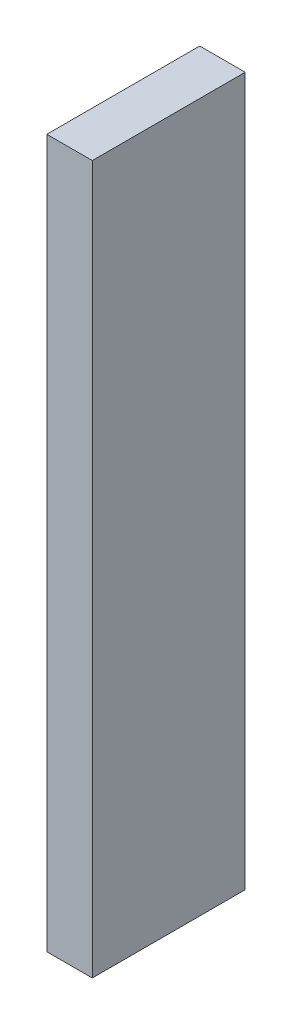
ISO-10303-21;
HEADER;
FILE_DESCRIPTION(('STEP AP214'),'2;1');
FILE_NAME('part.step','',(''),(''),'','','');
FILE_SCHEMA(('AUTOMOTIVE_DESIGN { 1 0 10303 214 1 1 1 1 }'));
ENDSEC;
DATA;
#1=APPLICATION_CONTEXT('core data for automotive mechanical design processes');
#2=APPLICATION_PROTOCOL_DEFINITION('international standard','automotive_design',2000,#1);
#3=PRODUCT_CONTEXT('',#1,'mechanical');
#4=PRODUCT('Part','Part','',(#3));
#5=PRODUCT_RELATED_PRODUCT_CATEGORY('part','',(#4));
#6=PRODUCT_DEFINITION_FORMATION('','',#4);
#7=PRODUCT_DEFINITION_CONTEXT('part definition',#1,'design');
#8=PRODUCT_DEFINITION('design','',#6,#7);
#9=PRODUCT_DEFINITION_SHAPE('','',#8);
#10=(LENGTH_UNIT() NAMED_UNIT(*) SI_UNIT(.MILLI.,.METRE.));
#11=(NAMED_UNIT(*) PLANE_ANGLE_UNIT() SI_UNIT($,.RADIAN.));
#12=(NAMED_UNIT(*) SI_UNIT($,.STERADIAN.) SOLID_ANGLE_UNIT());
#13=UNCERTAINTY_MEASURE_WITH_UNIT(LENGTH_MEASURE(1.E-05),#10,'distance_accuracy_value','');
#14=(GEOMETRIC_REPRESENTATION_CONTEXT(3) GLOBAL_UNCERTAINTY_ASSIGNED_CONTEXT((#13)) GLOBAL_UNIT_ASSIGNED_CONTEXT((#10,
#11,#12)) REPRESENTATION_CONTEXT('',''));
#15=CARTESIAN_POINT('',(0.,0.,0.));
#16=DIRECTION('',(0.,0.,1.));
#17=DIRECTION('',(1.,0.,0.));
#18=AXIS2_PLACEMENT_3D('',#15,#16,#17);
#19=CARTESIAN_POINT('',(130.275545161706,22.4180708263693,116.072024477607));
#20=DIRECTION('',(-1.69244514382854E-09,0.,1.));
#21=DIRECTION('',(1.,0.,1.69244514382854E-09));
#22=AXIS2_PLACEMENT_3D('',#19,#20,#21);
#23=PLANE('',#22);
#24=DIRECTION('',(0.,-1.,0.));
#25=VECTOR('',#24,1.);
#26=CARTESIAN_POINT('',(131.258630258719,22.4180708263693,116.072024479271));
#27=LINE('',#26,#25);
#28=CARTESIAN_POINT('',(131.258630258719,22.4180708263693,116.072024479271));
#29=VERTEX_POINT('',#28);
#30=CARTESIAN_POINT('',(131.258630258719,7.11212965552235,116.072024479271));
#31=VERTEX_POINT('',#30);
#32=EDGE_CURVE('E79',#29,#31,#27,.T.);
#33=ORIENTED_EDGE('',*,*,#32,.F.);
#34=DIRECTION('',(1.,0.,1.69244514382854E-09));
#35=VECTOR('',#34,1.);
#36=CARTESIAN_POINT('',(130.275545161706,22.4180708263693,116.072024477607));
#37=LINE('',#36,#35);
#38=CARTESIAN_POINT('',(130.275545161706,22.4180708263693,116.072024477607));
#39=VERTEX_POINT('',#38);
#40=EDGE_CURVE('E32',#39,#29,#37,.T.);
#41=ORIENTED_EDGE('',*,*,#40,.F.);
#42=DIRECTION('',(0.,-1.,0.));
#43=VECTOR('',#42,1.);
#44=CARTESIAN_POINT('',(130.275545161706,22.4180708263693,116.072024477607));
#45=LINE('',#44,#43);
#46=CARTESIAN_POINT('',(130.275545161706,7.11212965552235,116.072024477607));
#47=VERTEX_POINT('',#46);
#48=EDGE_CURVE('E71',#39,#47,#45,.T.);
#49=ORIENTED_EDGE('',*,*,#48,.T.);
#50=DIRECTION('',(1.,0.,1.69244514382854E-09));
#51=VECTOR('',#50,1.);
#52=CARTESIAN_POINT('',(130.275545161706,7.11212965552235,116.072024477607));
#53=LINE('',#52,#51);
#54=EDGE_CURVE('E10',#47,#31,#53,.T.);
#55=ORIENTED_EDGE('',*,*,#54,.T.);
#56=EDGE_LOOP('',(#33,#41,#49,#55));
#57=FACE_BOUND('',#56,.T.);
#58=ADVANCED_FACE('F16',(#57),#23,.T.);
#59=CARTESIAN_POINT('',(130.275545161706,7.11212965552235,116.072024477607));
#60=DIRECTION('',(0.,-1.,0.));
#61=DIRECTION('',(0.,0.,-1.));
#62=AXIS2_PLACEMENT_3D('',#59,#60,#61);
#63=PLANE('',#62);
#64=DIRECTION('',(1.69244514382854E-09,0.,-1.));
#65=VECTOR('',#64,1.);
#66=CARTESIAN_POINT('',(131.258630258719,7.11212965552235,116.072024479271));
#67=LINE('',#66,#65);
#68=CARTESIAN_POINT('',(131.258630264314,7.11212965552235,112.766083308422));
#69=VERTEX_POINT('',#68);
#70=EDGE_CURVE('E82',#31,#69,#67,.T.);
#71=ORIENTED_EDGE('',*,*,#70,.F.);
#72=ORIENTED_EDGE('',*,*,#54,.F.);
#73=DIRECTION('',(1.69244514382854E-09,0.,-1.));
#74=VECTOR('',#73,1.);
#75=CARTESIAN_POINT('',(130.275545161706,7.11212965552235,116.072024477607));
#76=LINE('',#75,#74);
#77=CARTESIAN_POINT('',(130.275545167301,7.11212965552235,112.766083306758));
#78=VERTEX_POINT('',#77);
#79=EDGE_CURVE('E67',#47,#78,#76,.T.);
#80=ORIENTED_EDGE('',*,*,#79,.T.);
#81=DIRECTION('',(1.,0.,1.69244514382854E-09));
#82=VECTOR('',#81,1.);
#83=CARTESIAN_POINT('',(130.275545167301,7.11212965552235,112.766083306758));
#84=LINE('',#83,#82);
#85=EDGE_CURVE('E24',#78,#69,#84,.T.);
#86=ORIENTED_EDGE('',*,*,#85,.T.);
#87=EDGE_LOOP('',(#71,#72,#80,#86));
#88=FACE_BOUND('',#87,.T.);
#89=ADVANCED_FACE('F68',(#88),#63,.T.);
#90=CARTESIAN_POINT('',(130.275545167301,7.11212965552235,112.766083306758));
#91=DIRECTION('',(1.69244514382854E-09,0.,-1.));
#92=DIRECTION('',(-1.,0.,-1.69244514382854E-09));
#93=AXIS2_PLACEMENT_3D('',#90,#91,#92);
#94=PLANE('',#93);
#95=DIRECTION('',(0.,1.,0.));
#96=VECTOR('',#95,1.);
#97=CARTESIAN_POINT('',(131.258630264314,7.11212965552235,112.766083308422));
#98=LINE('',#97,#96);
#99=CARTESIAN_POINT('',(131.258630264314,22.418070826371,112.766083299961));
#100=VERTEX_POINT('',#99);
#101=EDGE_CURVE('E65',#69,#100,#98,.T.);
#102=ORIENTED_EDGE('',*,*,#101,.F.);
#103=ORIENTED_EDGE('',*,*,#85,.F.);
#104=DIRECTION('',(0.,1.,0.));
#105=VECTOR('',#104,1.);
#106=CARTESIAN_POINT('',(130.275545167301,7.11212965552235,112.766083306758));
#107=LINE('',#106,#105);
#108=CARTESIAN_POINT('',(130.275545167301,22.418070826371,112.766083298297));
#109=VERTEX_POINT('',#108);
#110=EDGE_CURVE('E62',#78,#109,#107,.T.);
#111=ORIENTED_EDGE('',*,*,#110,.T.);
#112=DIRECTION('',(1.,0.,1.69244514382854E-09));
#113=VECTOR('',#112,1.);
#114=CARTESIAN_POINT('',(130.275545167301,22.418070826371,112.766083298297));
#115=LINE('',#114,#113);
#116=EDGE_CURVE('E48',#109,#100,#115,.T.);
#117=ORIENTED_EDGE('',*,*,#116,.T.);
#118=EDGE_LOOP('',(#102,#103,#111,#117));
#119=FACE_BOUND('',#118,.T.);
#120=ADVANCED_FACE('F60',(#119),#94,.T.);
#121=CARTESIAN_POINT('',(130.275545167301,22.418070826371,112.766083298297));
#122=DIRECTION('',(0.,1.,0.));
#123=DIRECTION('',(-1.,0.,0.));
#124=AXIS2_PLACEMENT_3D('',#121,#122,#123);
#125=PLANE('',#124);
#126=DIRECTION('',(-1.69244514382854E-09,0.,1.));
#127=VECTOR('',#126,1.);
#128=CARTESIAN_POINT('',(131.258630264314,22.418070826371,112.766083299961));
#129=LINE('',#128,#127);
#130=EDGE_CURVE('E85',#100,#29,#129,.T.);
#131=ORIENTED_EDGE('',*,*,#130,.F.);
#132=ORIENTED_EDGE('',*,*,#116,.F.);
#133=DIRECTION('',(-1.69244514382854E-09,0.,1.));
#134=VECTOR('',#133,1.);
#135=CARTESIAN_POINT('',(130.275545167301,22.418070826371,112.766083298297));
#136=LINE('',#135,#134);
#137=EDGE_CURVE('E74',#109,#39,#136,.T.);
#138=ORIENTED_EDGE('',*,*,#137,.T.);
#139=ORIENTED_EDGE('',*,*,#40,.T.);
#140=EDGE_LOOP('',(#131,#132,#138,#139));
#141=FACE_BOUND('',#140,.T.);
#142=ADVANCED_FACE('F96',(#141),#125,.T.);
#143=CARTESIAN_POINT('',(130.275545201028,17.2651002409467,92.8378607087388));
#144=DIRECTION('',(1.,0.,1.69244514382854E-09));
#145=DIRECTION('',(0.,1.,0.));
#146=AXIS2_PLACEMENT_3D('',#143,#144,#145);
#147=PLANE('',#146);
#148=ORIENTED_EDGE('',*,*,#48,.F.);
#149=ORIENTED_EDGE('',*,*,#137,.F.);
#150=ORIENTED_EDGE('',*,*,#110,.F.);
#151=ORIENTED_EDGE('',*,*,#79,.F.);
#152=EDGE_LOOP('',(#148,#149,#150,#151));
#153=FACE_BOUND('',#152,.T.);
#154=ADVANCED_FACE('F73',(#153),#147,.F.);
#155=CARTESIAN_POINT('',(131.258630298041,17.2651002409467,92.8378607104026));
#156=DIRECTION('',(1.,0.,1.69244514382854E-09));
#157=DIRECTION('',(0.,1.,0.));
#158=AXIS2_PLACEMENT_3D('',#155,#156,#157);
#159=PLANE('',#158);
#160=ORIENTED_EDGE('',*,*,#32,.T.);
#161=ORIENTED_EDGE('',*,*,#70,.T.);
#162=ORIENTED_EDGE('',*,*,#101,.T.);
#163=ORIENTED_EDGE('',*,*,#130,.T.);
#164=EDGE_LOOP('',(#160,#161,#162,#163));
#165=FACE_BOUND('',#164,.T.);
#166=ADVANCED_FACE('F89',(#165),#159,.T.);
#167=CLOSED_SHELL('',(#58,#89,#120,#142,#154,#166));
#168=MANIFOLD_SOLID_BREP('B1',#167);
#169=ADVANCED_BREP_SHAPE_REPRESENTATION('',(#18,#168),#14);
#170=SHAPE_DEFINITION_REPRESENTATION(#9,#169);
ENDSEC;
END-ISO-10303-21;
